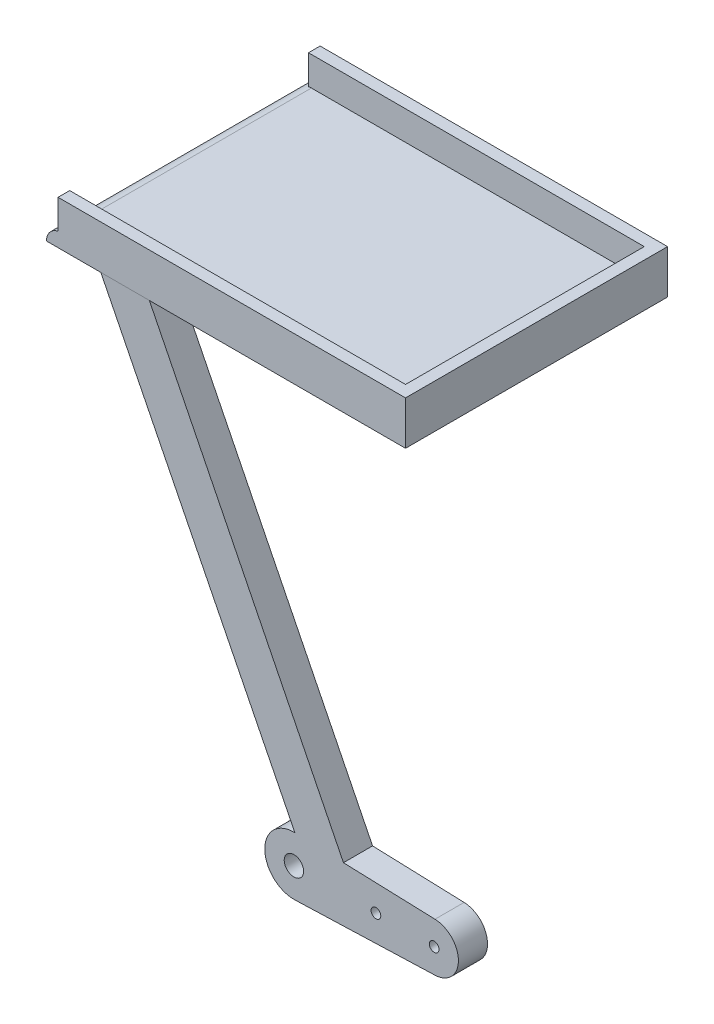
ISO-10303-21;
HEADER;
FILE_DESCRIPTION(('STEP AP214'),'2;1');
FILE_NAME('part.step','',(''),(''),'','','');
FILE_SCHEMA(('AUTOMOTIVE_DESIGN { 1 0 10303 214 1 1 1 1 }'));
ENDSEC;
DATA;
#1=APPLICATION_CONTEXT('core data for automotive mechanical design processes');
#2=APPLICATION_PROTOCOL_DEFINITION('international standard','automotive_design',2000,#1);
#3=PRODUCT_CONTEXT('',#1,'mechanical');
#4=PRODUCT('Part','Part','',(#3));
#5=PRODUCT_RELATED_PRODUCT_CATEGORY('part','',(#4));
#6=PRODUCT_DEFINITION_FORMATION('','',#4);
#7=PRODUCT_DEFINITION_CONTEXT('part definition',#1,'design');
#8=PRODUCT_DEFINITION('design','',#6,#7);
#9=PRODUCT_DEFINITION_SHAPE('','',#8);
#10=(LENGTH_UNIT() NAMED_UNIT(*) SI_UNIT(.MILLI.,.METRE.));
#11=(NAMED_UNIT(*) PLANE_ANGLE_UNIT() SI_UNIT($,.RADIAN.));
#12=(NAMED_UNIT(*) SI_UNIT($,.STERADIAN.) SOLID_ANGLE_UNIT());
#13=UNCERTAINTY_MEASURE_WITH_UNIT(LENGTH_MEASURE(1.E-05),#10,'distance_accuracy_value','');
#14=(GEOMETRIC_REPRESENTATION_CONTEXT(3) GLOBAL_UNCERTAINTY_ASSIGNED_CONTEXT((#13)) GLOBAL_UNIT_ASSIGNED_CONTEXT((#10,
#11,#12)) REPRESENTATION_CONTEXT('',''));
#15=CARTESIAN_POINT('',(0.,0.,0.));
#16=DIRECTION('',(0.,0.,1.));
#17=DIRECTION('',(1.,0.,0.));
#18=AXIS2_PLACEMENT_3D('',#15,#16,#17);
#19=CARTESIAN_POINT('',(0.,44.4982035065937,3.));
#20=DIRECTION('',(0.,0.,-1.));
#21=DIRECTION('',(-1.,0.,0.));
#22=AXIS2_PLACEMENT_3D('',#19,#20,#21);
#23=PLANE('',#22);
#24=DIRECTION('',(0.,-1.,0.));
#25=VECTOR('',#24,1.);
#26=CARTESIAN_POINT('',(-24.2999999999999,47.4982035065937,3.));
#27=LINE('',#26,#25);
#28=CARTESIAN_POINT('',(-24.2999999999999,47.4982035065937,3.));
#29=VERTEX_POINT('',#28);
#30=CARTESIAN_POINT('',(-24.2999999999999,44.4678973522636,3.));
#31=VERTEX_POINT('',#30);
#32=EDGE_CURVE('E162',#29,#31,#27,.T.);
#33=ORIENTED_EDGE('',*,*,#32,.T.);
#34=CARTESIAN_POINT('',(-23.9999999999999,42.9982035065937,3.));
#35=DIRECTION('',(0.,0.,-1.));
#36=DIRECTION('',(-1.,0.,0.));
#37=AXIS2_PLACEMENT_3D('',#34,#35,#36);
#38=CIRCLE('',#37,1.5);
#39=CARTESIAN_POINT('',(-25.4999999999999,42.9982035065937,3.));
#40=VERTEX_POINT('',#39);
#41=EDGE_CURVE('E190',#31,#40,#38,.F.);
#42=ORIENTED_EDGE('',*,*,#41,.T.);
#43=DIRECTION('',(1.,0.,0.));
#44=VECTOR('',#43,1.);
#45=CARTESIAN_POINT('',(0.,42.9982035065937,3.));
#46=LINE('',#45,#44);
#47=CARTESIAN_POINT('',(11.5000000000001,42.9982035065937,3.));
#48=VERTEX_POINT('',#47);
#49=EDGE_CURVE('E129',#40,#48,#46,.T.);
#50=ORIENTED_EDGE('',*,*,#49,.T.);
#51=DIRECTION('',(0.,-1.,0.));
#52=VECTOR('',#51,1.);
#53=CARTESIAN_POINT('',(11.5000000000001,44.4982035065937,3.));
#54=LINE('',#53,#52);
#55=CARTESIAN_POINT('',(11.5000000000001,47.4982035065937,3.));
#56=VERTEX_POINT('',#55);
#57=EDGE_CURVE('E124',#56,#48,#54,.T.);
#58=ORIENTED_EDGE('',*,*,#57,.F.);
#59=DIRECTION('',(1.,0.,0.));
#60=VECTOR('',#59,1.);
#61=CARTESIAN_POINT('',(11.5000000000001,47.4982035065937,3.));
#62=LINE('',#61,#60);
#63=EDGE_CURVE('E127',#29,#56,#62,.T.);
#64=ORIENTED_EDGE('',*,*,#63,.F.);
#65=EDGE_LOOP('',(#33,#42,#50,#58,#64));
#66=FACE_BOUND('',#65,.T.);
#67=ADVANCED_FACE('F45',(#66),#23,.F.);
#68=CARTESIAN_POINT('',(11.5000000000001,44.4982035065937,0.));
#69=DIRECTION('',(1.,0.,0.));
#70=DIRECTION('',(0.,1.,0.));
#71=AXIS2_PLACEMENT_3D('',#68,#69,#70);
#72=PLANE('',#71);
#73=DIRECTION('',(0.,0.,1.));
#74=VECTOR('',#73,1.);
#75=CARTESIAN_POINT('',(11.5000000000001,42.9982035065937,0.));
#76=LINE('',#75,#74);
#77=CARTESIAN_POINT('',(11.5000000000001,42.9982035065937,-24.));
#78=VERTEX_POINT('',#77);
#79=EDGE_CURVE('E179',#78,#48,#76,.T.);
#80=ORIENTED_EDGE('',*,*,#79,.F.);
#81=DIRECTION('',(0.,-1.,0.));
#82=VECTOR('',#81,1.);
#83=CARTESIAN_POINT('',(11.5000000000001,44.4982035065937,-24.));
#84=LINE('',#83,#82);
#85=CARTESIAN_POINT('',(11.5000000000001,47.4982035065937,-24.));
#86=VERTEX_POINT('',#85);
#87=EDGE_CURVE('E134',#86,#78,#84,.T.);
#88=ORIENTED_EDGE('',*,*,#87,.F.);
#89=DIRECTION('',(0.,0.,-1.));
#90=VECTOR('',#89,1.);
#91=CARTESIAN_POINT('',(11.5000000000001,47.4982035065937,-24.));
#92=LINE('',#91,#90);
#93=EDGE_CURVE('E137',#56,#86,#92,.T.);
#94=ORIENTED_EDGE('',*,*,#93,.F.);
#95=ORIENTED_EDGE('',*,*,#57,.T.);
#96=EDGE_LOOP('',(#80,#88,#94,#95));
#97=FACE_BOUND('',#96,.T.);
#98=ADVANCED_FACE('F138',(#97),#72,.T.);
#99=CARTESIAN_POINT('',(0.,44.4982035065937,-24.));
#100=DIRECTION('',(0.,0.,-1.));
#101=DIRECTION('',(-1.,0.,0.));
#102=AXIS2_PLACEMENT_3D('',#99,#100,#101);
#103=PLANE('',#102);
#104=CARTESIAN_POINT('',(-23.9999999999999,42.9982035065937,-24.));
#105=DIRECTION('',(0.,0.,-1.));
#106=DIRECTION('',(-1.,0.,0.));
#107=AXIS2_PLACEMENT_3D('',#104,#105,#106);
#108=CIRCLE('',#107,1.5);
#109=CARTESIAN_POINT('',(-25.4999999999999,42.9982035065937,-24.));
#110=VERTEX_POINT('',#109);
#111=CARTESIAN_POINT('',(-24.2999999999999,44.4678973522636,-24.));
#112=VERTEX_POINT('',#111);
#113=EDGE_CURVE('E192',#110,#112,#108,.T.);
#114=ORIENTED_EDGE('',*,*,#113,.T.);
#115=DIRECTION('',(0.,-1.,0.));
#116=VECTOR('',#115,1.);
#117=CARTESIAN_POINT('',(-24.2999999999999,47.4982035065937,-24.));
#118=LINE('',#117,#116);
#119=CARTESIAN_POINT('',(-24.2999999999999,47.4982035065937,-24.));
#120=VERTEX_POINT('',#119);
#121=EDGE_CURVE('E176',#120,#112,#118,.T.);
#122=ORIENTED_EDGE('',*,*,#121,.F.);
#123=DIRECTION('',(-1.,0.,0.));
#124=VECTOR('',#123,1.);
#125=CARTESIAN_POINT('',(-24.2999999999999,47.4982035065937,-24.));
#126=LINE('',#125,#124);
#127=EDGE_CURVE('E141',#86,#120,#126,.T.);
#128=ORIENTED_EDGE('',*,*,#127,.F.);
#129=ORIENTED_EDGE('',*,*,#87,.T.);
#130=DIRECTION('',(1.,0.,0.));
#131=VECTOR('',#130,1.);
#132=CARTESIAN_POINT('',(0.,42.9982035065937,-24.));
#133=LINE('',#132,#131);
#134=EDGE_CURVE('E181',#110,#78,#133,.T.);
#135=ORIENTED_EDGE('',*,*,#134,.F.);
#136=EDGE_LOOP('',(#114,#122,#128,#129,#135));
#137=FACE_BOUND('',#136,.T.);
#138=ADVANCED_FACE('F218',(#137),#103,.T.);
#139=CARTESIAN_POINT('',(0.,44.4982035065937,0.));
#140=DIRECTION('',(0.,1.,0.));
#141=DIRECTION('',(-1.,0.,0.));
#142=AXIS2_PLACEMENT_3D('',#139,#140,#141);
#143=PLANE('',#142);
#144=DIRECTION('',(1.,0.,0.));
#145=VECTOR('',#144,1.);
#146=CARTESIAN_POINT('',(10.3000000000001,44.4982035065937,-22.8));
#147=LINE('',#146,#145);
#148=CARTESIAN_POINT('',(-23.9999999999999,44.4982035065937,-22.8));
#149=VERTEX_POINT('',#148);
#150=CARTESIAN_POINT('',(10.3000000000001,44.4982035065937,-22.8));
#151=VERTEX_POINT('',#150);
#152=EDGE_CURVE('E163',#149,#151,#147,.T.);
#153=ORIENTED_EDGE('',*,*,#152,.F.);
#154=DIRECTION('',(0.,0.,1.));
#155=VECTOR('',#154,1.);
#156=CARTESIAN_POINT('',(-23.9999999999999,44.4982035065937,3.));
#157=LINE('',#156,#155);
#158=CARTESIAN_POINT('',(-23.9999999999999,44.4982035065937,1.8));
#159=VERTEX_POINT('',#158);
#160=EDGE_CURVE('E133',#149,#159,#157,.T.);
#161=ORIENTED_EDGE('',*,*,#160,.T.);
#162=DIRECTION('',(-1.,0.,0.));
#163=VECTOR('',#162,1.);
#164=CARTESIAN_POINT('',(-24.2999999999999,44.4982035065937,1.8));
#165=LINE('',#164,#163);
#166=CARTESIAN_POINT('',(10.3000000000001,44.4982035065937,1.8));
#167=VERTEX_POINT('',#166);
#168=EDGE_CURVE('E146',#167,#159,#165,.T.);
#169=ORIENTED_EDGE('',*,*,#168,.F.);
#170=DIRECTION('',(0.,0.,1.));
#171=VECTOR('',#170,1.);
#172=CARTESIAN_POINT('',(10.3000000000001,44.4982035065937,1.8));
#173=LINE('',#172,#171);
#174=EDGE_CURVE('E149',#151,#167,#173,.T.);
#175=ORIENTED_EDGE('',*,*,#174,.F.);
#176=EDGE_LOOP('',(#153,#161,#169,#175));
#177=FACE_BOUND('',#176,.T.);
#178=ADVANCED_FACE('F212',(#177),#143,.T.);
#179=CARTESIAN_POINT('',(0.,42.9982035065937,0.));
#180=DIRECTION('',(0.,1.,0.));
#181=DIRECTION('',(-1.,0.,0.));
#182=AXIS2_PLACEMENT_3D('',#179,#180,#181);
#183=PLANE('',#182);
#184=ORIENTED_EDGE('',*,*,#49,.F.);
#185=DIRECTION('',(0.,0.,1.));
#186=VECTOR('',#185,1.);
#187=CARTESIAN_POINT('',(-25.4999999999999,42.9982035065937,0.));
#188=LINE('',#187,#186);
#189=EDGE_CURVE('E184',#110,#40,#188,.T.);
#190=ORIENTED_EDGE('',*,*,#189,.F.);
#191=ORIENTED_EDGE('',*,*,#134,.T.);
#192=ORIENTED_EDGE('',*,*,#79,.T.);
#193=EDGE_LOOP('',(#184,#190,#191,#192));
#194=FACE_BOUND('',#193,.T.);
#195=ADVANCED_FACE('F223',(#194),#183,.F.);
#196=CARTESIAN_POINT('',(-24.2999999999999,47.4982035065937,-22.8));
#197=DIRECTION('',(1.,0.,0.));
#198=DIRECTION('',(0.,1.,0.));
#199=AXIS2_PLACEMENT_3D('',#196,#197,#198);
#200=PLANE('',#199);
#201=ORIENTED_EDGE('',*,*,#121,.T.);
#202=DIRECTION('',(0.,0.,-1.));
#203=VECTOR('',#202,1.);
#204=CARTESIAN_POINT('',(-24.2999999999999,44.4678973522636,-24.));
#205=LINE('',#204,#203);
#206=CARTESIAN_POINT('',(-24.2999999999999,44.4678973522636,-22.8));
#207=VERTEX_POINT('',#206);
#208=EDGE_CURVE('E53',#112,#207,#205,.F.);
#209=ORIENTED_EDGE('',*,*,#208,.T.);
#210=DIRECTION('',(0.,-1.,0.));
#211=VECTOR('',#210,1.);
#212=CARTESIAN_POINT('',(-24.2999999999999,47.4982035065937,-22.8));
#213=LINE('',#212,#211);
#214=CARTESIAN_POINT('',(-24.2999999999999,47.4982035065937,-22.8));
#215=VERTEX_POINT('',#214);
#216=EDGE_CURVE('E59',#215,#207,#213,.T.);
#217=ORIENTED_EDGE('',*,*,#216,.F.);
#218=DIRECTION('',(0.,0.,1.));
#219=VECTOR('',#218,1.);
#220=CARTESIAN_POINT('',(-24.2999999999999,47.4982035065937,-22.8));
#221=LINE('',#220,#219);
#222=EDGE_CURVE('E153',#120,#215,#221,.T.);
#223=ORIENTED_EDGE('',*,*,#222,.F.);
#224=EDGE_LOOP('',(#201,#209,#217,#223));
#225=FACE_BOUND('',#224,.T.);
#226=ADVANCED_FACE('F201',(#225),#200,.F.);
#227=CARTESIAN_POINT('',(10.3000000000001,47.4982035065937,-22.8));
#228=DIRECTION('',(0.,0.,-1.));
#229=DIRECTION('',(-1.,0.,0.));
#230=AXIS2_PLACEMENT_3D('',#227,#228,#229);
#231=PLANE('',#230);
#232=ORIENTED_EDGE('',*,*,#216,.T.);
#233=CARTESIAN_POINT('',(-23.9999999999999,42.9982035065937,-22.8));
#234=DIRECTION('',(0.,0.,-1.));
#235=DIRECTION('',(-1.,0.,0.));
#236=AXIS2_PLACEMENT_3D('',#233,#234,#235);
#237=CIRCLE('',#236,1.5);
#238=EDGE_CURVE('E12',#207,#149,#237,.T.);
#239=ORIENTED_EDGE('',*,*,#238,.T.);
#240=ORIENTED_EDGE('',*,*,#152,.T.);
#241=DIRECTION('',(0.,-1.,0.));
#242=VECTOR('',#241,1.);
#243=CARTESIAN_POINT('',(10.3000000000001,47.4982035065937,-22.8));
#244=LINE('',#243,#242);
#245=CARTESIAN_POINT('',(10.3000000000001,47.4982035065937,-22.8));
#246=VERTEX_POINT('',#245);
#247=EDGE_CURVE('E172',#246,#151,#244,.T.);
#248=ORIENTED_EDGE('',*,*,#247,.F.);
#249=DIRECTION('',(1.,0.,0.));
#250=VECTOR('',#249,1.);
#251=CARTESIAN_POINT('',(10.3000000000001,47.4982035065937,-22.8));
#252=LINE('',#251,#250);
#253=EDGE_CURVE('E155',#215,#246,#252,.T.);
#254=ORIENTED_EDGE('',*,*,#253,.F.);
#255=EDGE_LOOP('',(#232,#239,#240,#248,#254));
#256=FACE_BOUND('',#255,.T.);
#257=ADVANCED_FACE('F208',(#256),#231,.F.);
#258=CARTESIAN_POINT('',(10.3000000000001,47.4982035065937,1.8));
#259=DIRECTION('',(1.,0.,0.));
#260=DIRECTION('',(0.,1.,0.));
#261=AXIS2_PLACEMENT_3D('',#258,#259,#260);
#262=PLANE('',#261);
#263=ORIENTED_EDGE('',*,*,#174,.T.);
#264=DIRECTION('',(0.,-1.,0.));
#265=VECTOR('',#264,1.);
#266=CARTESIAN_POINT('',(10.3000000000001,47.4982035065937,1.8));
#267=LINE('',#266,#265);
#268=CARTESIAN_POINT('',(10.3000000000001,47.4982035065937,1.8));
#269=VERTEX_POINT('',#268);
#270=EDGE_CURVE('E169',#269,#167,#267,.T.);
#271=ORIENTED_EDGE('',*,*,#270,.F.);
#272=DIRECTION('',(0.,0.,1.));
#273=VECTOR('',#272,1.);
#274=CARTESIAN_POINT('',(10.3000000000001,47.4982035065937,1.8));
#275=LINE('',#274,#273);
#276=EDGE_CURVE('E157',#246,#269,#275,.T.);
#277=ORIENTED_EDGE('',*,*,#276,.F.);
#278=ORIENTED_EDGE('',*,*,#247,.T.);
#279=EDGE_LOOP('',(#263,#271,#277,#278));
#280=FACE_BOUND('',#279,.T.);
#281=ADVANCED_FACE('F216',(#280),#262,.F.);
#282=CARTESIAN_POINT('',(-24.2999999999999,47.4982035065937,1.8));
#283=DIRECTION('',(0.,0.,1.));
#284=DIRECTION('',(1.,0.,0.));
#285=AXIS2_PLACEMENT_3D('',#282,#283,#284);
#286=PLANE('',#285);
#287=ORIENTED_EDGE('',*,*,#168,.T.);
#288=CARTESIAN_POINT('',(-23.9999999999999,42.9982035065937,1.8));
#289=DIRECTION('',(0.,0.,1.));
#290=DIRECTION('',(1.,0.,0.));
#291=AXIS2_PLACEMENT_3D('',#288,#289,#290);
#292=CIRCLE('',#291,1.5);
#293=CARTESIAN_POINT('',(-24.2999999999999,44.4678973522636,1.8));
#294=VERTEX_POINT('',#293);
#295=EDGE_CURVE('E195',#159,#294,#292,.T.);
#296=ORIENTED_EDGE('',*,*,#295,.T.);
#297=DIRECTION('',(0.,-1.,0.));
#298=VECTOR('',#297,1.);
#299=CARTESIAN_POINT('',(-24.2999999999999,47.4982035065937,1.8));
#300=LINE('',#299,#298);
#301=CARTESIAN_POINT('',(-24.2999999999999,47.4982035065937,1.8));
#302=VERTEX_POINT('',#301);
#303=EDGE_CURVE('E67',#302,#294,#300,.T.);
#304=ORIENTED_EDGE('',*,*,#303,.F.);
#305=DIRECTION('',(-1.,0.,0.));
#306=VECTOR('',#305,1.);
#307=CARTESIAN_POINT('',(-24.2999999999999,47.4982035065937,1.8));
#308=LINE('',#307,#306);
#309=EDGE_CURVE('E159',#269,#302,#308,.T.);
#310=ORIENTED_EDGE('',*,*,#309,.F.);
#311=ORIENTED_EDGE('',*,*,#270,.T.);
#312=EDGE_LOOP('',(#287,#296,#304,#310,#311));
#313=FACE_BOUND('',#312,.T.);
#314=ADVANCED_FACE('F275',(#313),#286,.F.);
#315=CARTESIAN_POINT('',(-24.2999999999999,47.4982035065937,3.));
#316=DIRECTION('',(1.,0.,0.));
#317=DIRECTION('',(0.,1.,0.));
#318=AXIS2_PLACEMENT_3D('',#315,#316,#317);
#319=PLANE('',#318);
#320=ORIENTED_EDGE('',*,*,#303,.T.);
#321=DIRECTION('',(0.,0.,-1.));
#322=VECTOR('',#321,1.);
#323=CARTESIAN_POINT('',(-24.2999999999999,44.4678973522636,1.8));
#324=LINE('',#323,#322);
#325=EDGE_CURVE('E197',#294,#31,#324,.F.);
#326=ORIENTED_EDGE('',*,*,#325,.T.);
#327=ORIENTED_EDGE('',*,*,#32,.F.);
#328=DIRECTION('',(0.,0.,1.));
#329=VECTOR('',#328,1.);
#330=CARTESIAN_POINT('',(-24.2999999999999,47.4982035065937,3.));
#331=LINE('',#330,#329);
#332=EDGE_CURVE('E144',#302,#29,#331,.T.);
#333=ORIENTED_EDGE('',*,*,#332,.F.);
#334=EDGE_LOOP('',(#320,#326,#327,#333));
#335=FACE_BOUND('',#334,.T.);
#336=ADVANCED_FACE('F280',(#335),#319,.F.);
#337=CARTESIAN_POINT('',(0.,47.4982035065937,0.));
#338=DIRECTION('',(0.,-1.,0.));
#339=DIRECTION('',(1.,0.,0.));
#340=AXIS2_PLACEMENT_3D('',#337,#338,#339);
#341=PLANE('',#340);
#342=ORIENTED_EDGE('',*,*,#63,.T.);
#343=ORIENTED_EDGE('',*,*,#93,.T.);
#344=ORIENTED_EDGE('',*,*,#127,.T.);
#345=ORIENTED_EDGE('',*,*,#222,.T.);
#346=ORIENTED_EDGE('',*,*,#253,.T.);
#347=ORIENTED_EDGE('',*,*,#276,.T.);
#348=ORIENTED_EDGE('',*,*,#309,.T.);
#349=ORIENTED_EDGE('',*,*,#332,.T.);
#350=EDGE_LOOP('',(#342,#343,#344,#345,#346,#347,#348,#349));
#351=FACE_BOUND('',#350,.T.);
#352=ADVANCED_FACE('F143',(#351),#341,.F.);
#353=CARTESIAN_POINT('',(-23.9999999999999,42.9982035065937,0.));
#354=DIRECTION('',(0.,0.,-1.));
#355=DIRECTION('',(-1.,0.,0.));
#356=AXIS2_PLACEMENT_3D('',#353,#354,#355);
#357=CYLINDRICAL_SURFACE('',#356,1.5);
#358=ORIENTED_EDGE('',*,*,#113,.F.);
#359=ORIENTED_EDGE('',*,*,#189,.T.);
#360=ORIENTED_EDGE('',*,*,#41,.F.);
#361=ORIENTED_EDGE('',*,*,#325,.F.);
#362=ORIENTED_EDGE('',*,*,#295,.F.);
#363=ORIENTED_EDGE('',*,*,#160,.F.);
#364=ORIENTED_EDGE('',*,*,#238,.F.);
#365=ORIENTED_EDGE('',*,*,#208,.F.);
#366=EDGE_LOOP('',(#358,#359,#360,#361,#362,#363,#364,#365));
#367=FACE_BOUND('',#366,.T.);
#368=ADVANCED_FACE('F47',(#367),#357,.T.);
#369=CLOSED_SHELL('',(#67,#98,#138,#178,#195,#226,#257,#281,#314,#336,#352,#368));
#370=MANIFOLD_SOLID_BREP('B2',#369);
#371=CARTESIAN_POINT('',(14.45,0.,3.));
#372=DIRECTION('',(0.,0.,-1.));
#373=DIRECTION('',(-1.,0.,0.));
#374=AXIS2_PLACEMENT_3D('',#371,#372,#373);
#375=PLANE('',#374);
#376=DIRECTION('',(-1.,0.,0.));
#377=VECTOR('',#376,1.);
#378=CARTESIAN_POINT('',(-19.8961937716263,42.9982035065937,3.));
#379=LINE('',#378,#377);
#380=CARTESIAN_POINT('',(-14.8961937716263,42.9982035065937,3.));
#381=VERTEX_POINT('',#380);
#382=CARTESIAN_POINT('',(-19.8961937716263,42.9982035065937,3.));
#383=VERTEX_POINT('',#382);
#384=EDGE_CURVE('E447',#381,#383,#379,.T.);
#385=ORIENTED_EDGE('',*,*,#384,.T.);
#386=DIRECTION('',(0.447213595499958,-0.894427190999916,0.));
#387=VECTOR('',#386,1.);
#388=CARTESIAN_POINT('',(0.103806228373702,2.99820350659371,3.));
#389=LINE('',#388,#387);
#390=CARTESIAN_POINT('',(0.103806228373702,2.99820350659371,3.));
#391=VERTEX_POINT('',#390);
#392=EDGE_CURVE('E400',#383,#391,#389,.T.);
#393=ORIENTED_EDGE('',*,*,#392,.T.);
#394=CARTESIAN_POINT('',(0.,0.,3.));
#395=DIRECTION('',(0.,0.,1.));
#396=DIRECTION('',(1.,0.,0.));
#397=AXIS2_PLACEMENT_3D('',#394,#395,#396);
#398=CIRCLE('',#397,3.);
#399=CARTESIAN_POINT('',(0.103806228373702,-2.99820350659371,3.));
#400=VERTEX_POINT('',#399);
#401=EDGE_CURVE('E459',#391,#400,#398,.T.);
#402=ORIENTED_EDGE('',*,*,#401,.T.);
#403=DIRECTION('',(0.99940116886457,0.0346020761245675,0.));
#404=VECTOR('',#403,1.);
#405=CARTESIAN_POINT('',(0.103806228373702,-2.99820350659371,3.));
#406=LINE('',#405,#404);
#407=CARTESIAN_POINT('',(14.5365051903114,-2.49850292216142,3.));
#408=VERTEX_POINT('',#407);
#409=EDGE_CURVE('E416',#400,#408,#406,.T.);
#410=ORIENTED_EDGE('',*,*,#409,.T.);
#411=CARTESIAN_POINT('',(14.45,0.,3.));
#412=DIRECTION('',(0.,0.,1.));
#413=DIRECTION('',(-1.,0.,0.));
#414=AXIS2_PLACEMENT_3D('',#411,#412,#413);
#415=CIRCLE('',#414,2.5);
#416=CARTESIAN_POINT('',(14.5365051903114,2.49850292216143,3.));
#417=VERTEX_POINT('',#416);
#418=EDGE_CURVE('E410',#408,#417,#415,.T.);
#419=ORIENTED_EDGE('',*,*,#418,.T.);
#420=DIRECTION('',(-0.99940116886457,0.0346020761245674,0.));
#421=VECTOR('',#420,1.);
#422=CARTESIAN_POINT('',(5.10380622837371,2.82508945988973,3.));
#423=LINE('',#422,#421);
#424=CARTESIAN_POINT('',(5.10380622837371,2.82508945988973,3.));
#425=VERTEX_POINT('',#424);
#426=EDGE_CURVE('E414',#417,#425,#423,.T.);
#427=ORIENTED_EDGE('',*,*,#426,.T.);
#428=DIRECTION('',(-0.445669895619782,0.895197377195807,0.));
#429=VECTOR('',#428,1.);
#430=CARTESIAN_POINT('',(-14.8961937716263,42.9982035065937,3.));
#431=LINE('',#430,#429);
#432=EDGE_CURVE('E360',#425,#381,#431,.T.);
#433=ORIENTED_EDGE('',*,*,#432,.T.);
#434=EDGE_LOOP('',(#385,#393,#402,#410,#419,#427,#433));
#435=FACE_BOUND('',#434,.T.);
#436=CARTESIAN_POINT('',(0.,0.,3.));
#437=DIRECTION('',(0.,0.,1.));
#438=DIRECTION('',(1.,0.,0.));
#439=AXIS2_PLACEMENT_3D('',#436,#437,#438);
#440=CIRCLE('',#439,1.);
#441=CARTESIAN_POINT('',(1.,0.,3.));
#442=VERTEX_POINT('',#441);
#443=EDGE_CURVE('E438',#442,#442,#440,.T.);
#444=ORIENTED_EDGE('',*,*,#443,.F.);
#445=EDGE_LOOP('',(#444));
#446=FACE_BOUND('',#445,.T.);
#447=CARTESIAN_POINT('',(8.45,0.,3.));
#448=DIRECTION('',(0.,0.,1.));
#449=DIRECTION('',(1.,0.,0.));
#450=AXIS2_PLACEMENT_3D('',#447,#448,#449);
#451=CIRCLE('',#450,0.500000000000001);
#452=CARTESIAN_POINT('',(8.95,0.,3.));
#453=VERTEX_POINT('',#452);
#454=EDGE_CURVE('E474',#453,#453,#451,.T.);
#455=ORIENTED_EDGE('',*,*,#454,.F.);
#456=EDGE_LOOP('',(#455));
#457=FACE_BOUND('',#456,.T.);
#458=CARTESIAN_POINT('',(14.45,0.,3.));
#459=DIRECTION('',(0.,0.,1.));
#460=DIRECTION('',(1.,0.,0.));
#461=AXIS2_PLACEMENT_3D('',#458,#459,#460);
#462=CIRCLE('',#461,0.499999999999999);
#463=CARTESIAN_POINT('',(14.95,0.,3.));
#464=VERTEX_POINT('',#463);
#465=EDGE_CURVE('E480',#464,#464,#462,.T.);
#466=ORIENTED_EDGE('',*,*,#465,.F.);
#467=EDGE_LOOP('',(#466));
#468=FACE_BOUND('',#467,.T.);
#469=ADVANCED_FACE('F343',(#435,#446,#457,#468),#375,.F.);
#470=CARTESIAN_POINT('',(14.45,0.,0.));
#471=DIRECTION('',(0.,0.,-1.));
#472=DIRECTION('',(-1.,0.,0.));
#473=AXIS2_PLACEMENT_3D('',#470,#471,#472);
#474=PLANE('',#473);
#475=CARTESIAN_POINT('',(8.45,0.,0.));
#476=DIRECTION('',(0.,0.,1.));
#477=DIRECTION('',(1.,0.,0.));
#478=AXIS2_PLACEMENT_3D('',#475,#476,#477);
#479=CIRCLE('',#478,0.500000000000001);
#480=CARTESIAN_POINT('',(8.95,0.,0.));
#481=VERTEX_POINT('',#480);
#482=EDGE_CURVE('E477',#481,#481,#479,.T.);
#483=ORIENTED_EDGE('',*,*,#482,.T.);
#484=EDGE_LOOP('',(#483));
#485=FACE_BOUND('',#484,.T.);
#486=DIRECTION('',(-1.,0.,0.));
#487=VECTOR('',#486,1.);
#488=CARTESIAN_POINT('',(-19.8961937716263,42.9982035065937,0.));
#489=LINE('',#488,#487);
#490=CARTESIAN_POINT('',(-14.8961937716263,42.9982035065937,0.));
#491=VERTEX_POINT('',#490);
#492=CARTESIAN_POINT('',(-19.8961937716263,42.9982035065937,0.));
#493=VERTEX_POINT('',#492);
#494=EDGE_CURVE('E434',#491,#493,#489,.T.);
#495=ORIENTED_EDGE('',*,*,#494,.F.);
#496=DIRECTION('',(-0.445669895619782,0.895197377195807,0.));
#497=VECTOR('',#496,1.);
#498=CARTESIAN_POINT('',(-14.8961937716263,42.9982035065937,0.));
#499=LINE('',#498,#497);
#500=CARTESIAN_POINT('',(5.10380622837371,2.82508945988973,0.));
#501=VERTEX_POINT('',#500);
#502=EDGE_CURVE('E392',#501,#491,#499,.T.);
#503=ORIENTED_EDGE('',*,*,#502,.F.);
#504=DIRECTION('',(-0.99940116886457,0.0346020761245674,0.));
#505=VECTOR('',#504,1.);
#506=CARTESIAN_POINT('',(5.10380622837371,2.82508945988973,0.));
#507=LINE('',#506,#505);
#508=CARTESIAN_POINT('',(14.5365051903114,2.49850292216143,0.));
#509=VERTEX_POINT('',#508);
#510=EDGE_CURVE('E386',#509,#501,#507,.T.);
#511=ORIENTED_EDGE('',*,*,#510,.F.);
#512=CARTESIAN_POINT('',(14.45,0.,0.));
#513=DIRECTION('',(0.,0.,1.));
#514=DIRECTION('',(-1.,0.,0.));
#515=AXIS2_PLACEMENT_3D('',#512,#513,#514);
#516=CIRCLE('',#515,2.5);
#517=CARTESIAN_POINT('',(14.5365051903114,-2.49850292216142,0.));
#518=VERTEX_POINT('',#517);
#519=EDGE_CURVE('E424',#518,#509,#516,.T.);
#520=ORIENTED_EDGE('',*,*,#519,.F.);
#521=DIRECTION('',(0.99940116886457,0.0346020761245675,0.));
#522=VECTOR('',#521,1.);
#523=CARTESIAN_POINT('',(0.103806228373702,-2.99820350659371,0.));
#524=LINE('',#523,#522);
#525=CARTESIAN_POINT('',(0.103806228373702,-2.99820350659371,0.));
#526=VERTEX_POINT('',#525);
#527=EDGE_CURVE('E442',#526,#518,#524,.T.);
#528=ORIENTED_EDGE('',*,*,#527,.F.);
#529=CARTESIAN_POINT('',(0.,0.,0.));
#530=DIRECTION('',(0.,0.,1.));
#531=DIRECTION('',(1.,0.,0.));
#532=AXIS2_PLACEMENT_3D('',#529,#530,#531);
#533=CIRCLE('',#532,3.);
#534=CARTESIAN_POINT('',(0.103806228373702,2.99820350659371,0.));
#535=VERTEX_POINT('',#534);
#536=EDGE_CURVE('E440',#535,#526,#533,.T.);
#537=ORIENTED_EDGE('',*,*,#536,.F.);
#538=DIRECTION('',(0.447213595499958,-0.894427190999916,0.));
#539=VECTOR('',#538,1.);
#540=CARTESIAN_POINT('',(0.103806228373702,2.99820350659371,0.));
#541=LINE('',#540,#539);
#542=EDGE_CURVE('E437',#493,#535,#541,.T.);
#543=ORIENTED_EDGE('',*,*,#542,.F.);
#544=EDGE_LOOP('',(#495,#503,#511,#520,#528,#537,#543));
#545=FACE_BOUND('',#544,.T.);
#546=CARTESIAN_POINT('',(0.,0.,0.));
#547=DIRECTION('',(0.,0.,1.));
#548=DIRECTION('',(1.,0.,0.));
#549=AXIS2_PLACEMENT_3D('',#546,#547,#548);
#550=CIRCLE('',#549,1.);
#551=CARTESIAN_POINT('',(1.,0.,0.));
#552=VERTEX_POINT('',#551);
#553=EDGE_CURVE('E471',#552,#552,#550,.T.);
#554=ORIENTED_EDGE('',*,*,#553,.T.);
#555=EDGE_LOOP('',(#554));
#556=FACE_BOUND('',#555,.T.);
#557=CARTESIAN_POINT('',(14.45,0.,0.));
#558=DIRECTION('',(0.,0.,1.));
#559=DIRECTION('',(1.,0.,0.));
#560=AXIS2_PLACEMENT_3D('',#557,#558,#559);
#561=CIRCLE('',#560,0.499999999999999);
#562=CARTESIAN_POINT('',(14.95,0.,0.));
#563=VERTEX_POINT('',#562);
#564=EDGE_CURVE('E483',#563,#563,#561,.T.);
#565=ORIENTED_EDGE('',*,*,#564,.T.);
#566=EDGE_LOOP('',(#565));
#567=FACE_BOUND('',#566,.T.);
#568=ADVANCED_FACE('F463',(#485,#545,#556,#567),#474,.T.);
#569=CARTESIAN_POINT('',(-19.8961937716263,42.9982035065937,3.));
#570=DIRECTION('',(0.,-1.,0.));
#571=DIRECTION('',(1.,0.,0.));
#572=AXIS2_PLACEMENT_3D('',#569,#570,#571);
#573=PLANE('',#572);
#574=ORIENTED_EDGE('',*,*,#494,.T.);
#575=DIRECTION('',(0.,0.,-1.));
#576=VECTOR('',#575,1.);
#577=CARTESIAN_POINT('',(-19.8961937716263,42.9982035065937,3.));
#578=LINE('',#577,#576);
#579=EDGE_CURVE('E43',#383,#493,#578,.T.);
#580=ORIENTED_EDGE('',*,*,#579,.F.);
#581=ORIENTED_EDGE('',*,*,#384,.F.);
#582=DIRECTION('',(0.,0.,-1.));
#583=VECTOR('',#582,1.);
#584=CARTESIAN_POINT('',(-14.8961937716263,42.9982035065937,3.));
#585=LINE('',#584,#583);
#586=EDGE_CURVE('E430',#381,#491,#585,.T.);
#587=ORIENTED_EDGE('',*,*,#586,.T.);
#588=EDGE_LOOP('',(#574,#580,#581,#587));
#589=FACE_BOUND('',#588,.T.);
#590=ADVANCED_FACE('F345',(#589),#573,.F.);
#591=CARTESIAN_POINT('',(0.103806228373702,2.99820350659371,3.));
#592=DIRECTION('',(0.894427190999916,0.447213595499958,0.));
#593=DIRECTION('',(-0.447213595499958,0.894427190999916,0.));
#594=AXIS2_PLACEMENT_3D('',#591,#592,#593);
#595=PLANE('',#594);
#596=ORIENTED_EDGE('',*,*,#542,.T.);
#597=DIRECTION('',(0.,0.,-1.));
#598=VECTOR('',#597,1.);
#599=CARTESIAN_POINT('',(0.103806228373702,2.99820350659371,3.));
#600=LINE('',#599,#598);
#601=EDGE_CURVE('E352',#391,#535,#600,.T.);
#602=ORIENTED_EDGE('',*,*,#601,.F.);
#603=ORIENTED_EDGE('',*,*,#392,.F.);
#604=ORIENTED_EDGE('',*,*,#579,.T.);
#605=EDGE_LOOP('',(#596,#602,#603,#604));
#606=FACE_BOUND('',#605,.T.);
#607=ADVANCED_FACE('F513',(#606),#595,.F.);
#608=CARTESIAN_POINT('',(0.,0.,3.));
#609=DIRECTION('',(0.,0.,-1.));
#610=DIRECTION('',(-1.,0.,0.));
#611=AXIS2_PLACEMENT_3D('',#608,#609,#610);
#612=CYLINDRICAL_SURFACE('',#611,3.);
#613=ORIENTED_EDGE('',*,*,#536,.T.);
#614=DIRECTION('',(0.,0.,-1.));
#615=VECTOR('',#614,1.);
#616=CARTESIAN_POINT('',(0.103806228373702,-2.99820350659371,3.));
#617=LINE('',#616,#615);
#618=EDGE_CURVE('E451',#400,#526,#617,.T.);
#619=ORIENTED_EDGE('',*,*,#618,.F.);
#620=ORIENTED_EDGE('',*,*,#401,.F.);
#621=ORIENTED_EDGE('',*,*,#601,.T.);
#622=EDGE_LOOP('',(#613,#619,#620,#621));
#623=FACE_BOUND('',#622,.T.);
#624=ADVANCED_FACE('F457',(#623),#612,.T.);
#625=CARTESIAN_POINT('',(0.103806228373702,-2.99820350659371,3.));
#626=DIRECTION('',(-0.0346020761245675,0.99940116886457,0.));
#627=DIRECTION('',(-0.999401168864571,-0.0346020761245675,0.));
#628=AXIS2_PLACEMENT_3D('',#625,#626,#627);
#629=PLANE('',#628);
#630=ORIENTED_EDGE('',*,*,#527,.T.);
#631=DIRECTION('',(0.,0.,-1.));
#632=VECTOR('',#631,1.);
#633=CARTESIAN_POINT('',(14.5365051903114,-2.49850292216142,3.));
#634=LINE('',#633,#632);
#635=EDGE_CURVE('E425',#408,#518,#634,.T.);
#636=ORIENTED_EDGE('',*,*,#635,.F.);
#637=ORIENTED_EDGE('',*,*,#409,.F.);
#638=ORIENTED_EDGE('',*,*,#618,.T.);
#639=EDGE_LOOP('',(#630,#636,#637,#638));
#640=FACE_BOUND('',#639,.T.);
#641=ADVANCED_FACE('F466',(#640),#629,.F.);
#642=CARTESIAN_POINT('',(14.45,0.,3.));
#643=DIRECTION('',(0.,0.,-1.));
#644=DIRECTION('',(-1.,0.,0.));
#645=AXIS2_PLACEMENT_3D('',#642,#643,#644);
#646=CYLINDRICAL_SURFACE('',#645,2.5);
#647=ORIENTED_EDGE('',*,*,#519,.T.);
#648=DIRECTION('',(0.,0.,-1.));
#649=VECTOR('',#648,1.);
#650=CARTESIAN_POINT('',(14.5365051903114,2.49850292216143,3.));
#651=LINE('',#650,#649);
#652=EDGE_CURVE('E421',#417,#509,#651,.T.);
#653=ORIENTED_EDGE('',*,*,#652,.F.);
#654=ORIENTED_EDGE('',*,*,#418,.F.);
#655=ORIENTED_EDGE('',*,*,#635,.T.);
#656=EDGE_LOOP('',(#647,#653,#654,#655));
#657=FACE_BOUND('',#656,.T.);
#658=ADVANCED_FACE('F422',(#657),#646,.T.);
#659=CARTESIAN_POINT('',(5.10380622837371,2.82508945988973,3.));
#660=DIRECTION('',(-0.0346020761245674,-0.99940116886457,0.));
#661=DIRECTION('',(0.999401168864571,-0.0346020761245674,0.));
#662=AXIS2_PLACEMENT_3D('',#659,#660,#661);
#663=PLANE('',#662);
#664=ORIENTED_EDGE('',*,*,#510,.T.);
#665=DIRECTION('',(0.,0.,-1.));
#666=VECTOR('',#665,1.);
#667=CARTESIAN_POINT('',(5.10380622837371,2.82508945988973,3.));
#668=LINE('',#667,#666);
#669=EDGE_CURVE('E426',#425,#501,#668,.T.);
#670=ORIENTED_EDGE('',*,*,#669,.F.);
#671=ORIENTED_EDGE('',*,*,#426,.F.);
#672=ORIENTED_EDGE('',*,*,#652,.T.);
#673=EDGE_LOOP('',(#664,#670,#671,#672));
#674=FACE_BOUND('',#673,.T.);
#675=ADVANCED_FACE('F428',(#674),#663,.F.);
#676=CARTESIAN_POINT('',(-14.8961937716263,42.9982035065937,3.));
#677=DIRECTION('',(-0.895197377195807,-0.445669895619782,0.));
#678=DIRECTION('',(0.445669895619782,-0.895197377195807,0.));
#679=AXIS2_PLACEMENT_3D('',#676,#677,#678);
#680=PLANE('',#679);
#681=ORIENTED_EDGE('',*,*,#502,.T.);
#682=ORIENTED_EDGE('',*,*,#586,.F.);
#683=ORIENTED_EDGE('',*,*,#432,.F.);
#684=ORIENTED_EDGE('',*,*,#669,.T.);
#685=EDGE_LOOP('',(#681,#682,#683,#684));
#686=FACE_BOUND('',#685,.T.);
#687=ADVANCED_FACE('F503',(#686),#680,.F.);
#688=CARTESIAN_POINT('',(0.,0.,3.));
#689=DIRECTION('',(0.,0.,-1.));
#690=DIRECTION('',(-1.,0.,0.));
#691=AXIS2_PLACEMENT_3D('',#688,#689,#690);
#692=CYLINDRICAL_SURFACE('',#691,1.);
#693=ORIENTED_EDGE('',*,*,#443,.T.);
#694=EDGE_LOOP('',(#693));
#695=FACE_BOUND('',#694,.T.);
#696=ORIENTED_EDGE('',*,*,#553,.F.);
#697=EDGE_LOOP('',(#696));
#698=FACE_BOUND('',#697,.T.);
#699=ADVANCED_FACE('F500',(#695,#698),#692,.F.);
#700=CARTESIAN_POINT('',(8.45,0.,3.));
#701=DIRECTION('',(0.,0.,-1.));
#702=DIRECTION('',(-1.,0.,0.));
#703=AXIS2_PLACEMENT_3D('',#700,#701,#702);
#704=CYLINDRICAL_SURFACE('',#703,0.500000000000001);
#705=ORIENTED_EDGE('',*,*,#454,.T.);
#706=EDGE_LOOP('',(#705));
#707=FACE_BOUND('',#706,.T.);
#708=ORIENTED_EDGE('',*,*,#482,.F.);
#709=EDGE_LOOP('',(#708));
#710=FACE_BOUND('',#709,.T.);
#711=ADVANCED_FACE('F572',(#707,#710),#704,.F.);
#712=CARTESIAN_POINT('',(14.45,0.,3.));
#713=DIRECTION('',(0.,0.,-1.));
#714=DIRECTION('',(-1.,0.,0.));
#715=AXIS2_PLACEMENT_3D('',#712,#713,#714);
#716=CYLINDRICAL_SURFACE('',#715,0.499999999999999);
#717=ORIENTED_EDGE('',*,*,#465,.T.);
#718=EDGE_LOOP('',(#717));
#719=FACE_BOUND('',#718,.T.);
#720=ORIENTED_EDGE('',*,*,#564,.F.);
#721=EDGE_LOOP('',(#720));
#722=FACE_BOUND('',#721,.T.);
#723=ADVANCED_FACE('F489',(#719,#722),#716,.F.);
#724=CLOSED_SHELL('',(#469,#568,#590,#607,#624,#641,#658,#675,#687,#699,#711,#723));
#725=MANIFOLD_SOLID_BREP('B6',#724);
#726=ADVANCED_BREP_SHAPE_REPRESENTATION('',(#18,#370,#725),#14);
#727=SHAPE_DEFINITION_REPRESENTATION(#9,#726);
ENDSEC;
END-ISO-10303-21;
